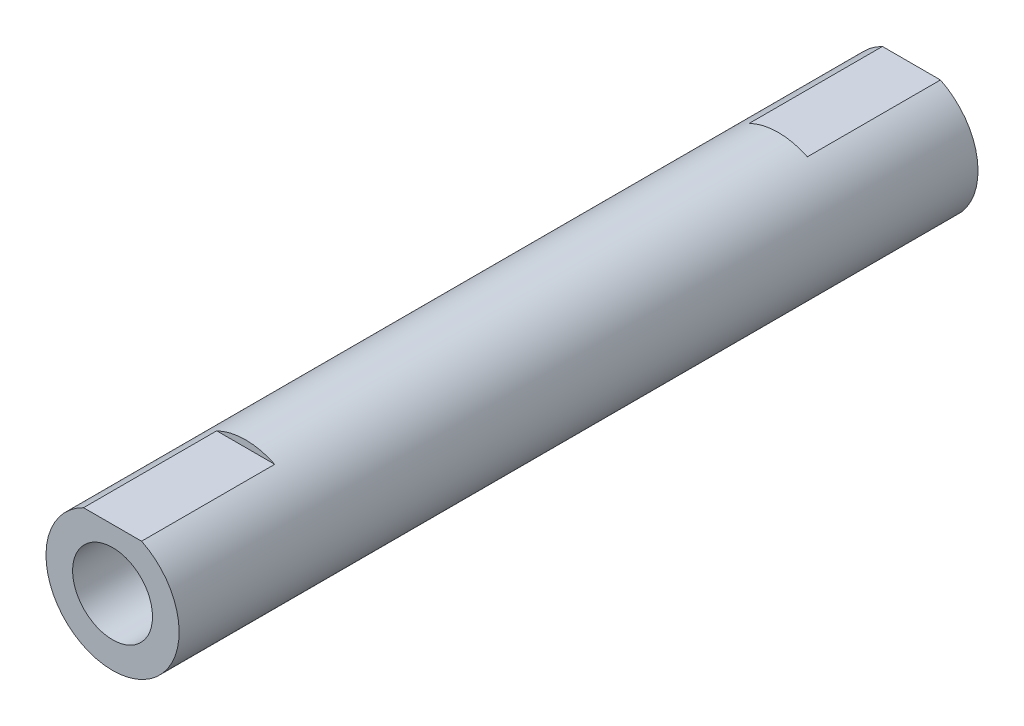
ISO-10303-21;
HEADER;
FILE_DESCRIPTION(('STEP AP214'),'2;1');
FILE_NAME('part.step','',(''),(''),'','','');
FILE_SCHEMA(('AUTOMOTIVE_DESIGN { 1 0 10303 214 1 1 1 1 }'));
ENDSEC;
DATA;
#1=APPLICATION_CONTEXT('core data for automotive mechanical design processes');
#2=APPLICATION_PROTOCOL_DEFINITION('international standard','automotive_design',2000,#1);
#3=PRODUCT_CONTEXT('',#1,'mechanical');
#4=PRODUCT('Part','Part','',(#3));
#5=PRODUCT_RELATED_PRODUCT_CATEGORY('part','',(#4));
#6=PRODUCT_DEFINITION_FORMATION('','',#4);
#7=PRODUCT_DEFINITION_CONTEXT('part definition',#1,'design');
#8=PRODUCT_DEFINITION('design','',#6,#7);
#9=PRODUCT_DEFINITION_SHAPE('','',#8);
#10=(LENGTH_UNIT() NAMED_UNIT(*) SI_UNIT(.MILLI.,.METRE.));
#11=(NAMED_UNIT(*) PLANE_ANGLE_UNIT() SI_UNIT($,.RADIAN.));
#12=(NAMED_UNIT(*) SI_UNIT($,.STERADIAN.) SOLID_ANGLE_UNIT());
#13=UNCERTAINTY_MEASURE_WITH_UNIT(LENGTH_MEASURE(1.E-05),#10,'distance_accuracy_value','');
#14=(GEOMETRIC_REPRESENTATION_CONTEXT(3) GLOBAL_UNCERTAINTY_ASSIGNED_CONTEXT((#13)) GLOBAL_UNIT_ASSIGNED_CONTEXT((#10,
#11,#12)) REPRESENTATION_CONTEXT('',''));
#15=CARTESIAN_POINT('',(0.,0.,0.));
#16=DIRECTION('',(0.,0.,1.));
#17=DIRECTION('',(1.,0.,0.));
#18=AXIS2_PLACEMENT_3D('',#15,#16,#17);
#19=CARTESIAN_POINT('',(0.,0.,30.));
#20=DIRECTION('',(0.,0.,1.));
#21=DIRECTION('',(1.,0.,0.));
#22=AXIS2_PLACEMENT_3D('',#19,#20,#21);
#23=PLANE('',#22);
#24=CARTESIAN_POINT('',(0.,0.,30.));
#25=DIRECTION('',(0.,0.,1.));
#26=DIRECTION('',(1.,0.,0.));
#27=AXIS2_PLACEMENT_3D('',#24,#25,#26);
#28=CIRCLE('',#27,3.);
#29=CARTESIAN_POINT('',(3.,0.,30.));
#30=VERTEX_POINT('',#29);
#31=EDGE_CURVE('E120',#30,#30,#28,.T.);
#32=ORIENTED_EDGE('',*,*,#31,.F.);
#33=EDGE_LOOP('',(#32));
#34=FACE_BOUND('',#33,.T.);
#35=CARTESIAN_POINT('',(0.,0.,30.));
#36=DIRECTION('',(0.,0.,1.));
#37=DIRECTION('',(1.,0.,0.));
#38=AXIS2_PLACEMENT_3D('',#35,#36,#37);
#39=CIRCLE('',#38,5.);
#40=CARTESIAN_POINT('',(-2.17944947177034,4.5,30.));
#41=VERTEX_POINT('',#40);
#42=CARTESIAN_POINT('',(2.17944947177034,4.5,30.));
#43=VERTEX_POINT('',#42);
#44=EDGE_CURVE('E11',#41,#43,#39,.T.);
#45=ORIENTED_EDGE('',*,*,#44,.T.);
#46=DIRECTION('',(-1.,0.,0.));
#47=VECTOR('',#46,1.);
#48=CARTESIAN_POINT('',(2.17944947177034,4.5,30.));
#49=LINE('',#48,#47);
#50=EDGE_CURVE('E100',#43,#41,#49,.T.);
#51=ORIENTED_EDGE('',*,*,#50,.T.);
#52=EDGE_LOOP('',(#45,#51));
#53=FACE_BOUND('',#52,.T.);
#54=ADVANCED_FACE('F39',(#34,#53),#23,.T.);
#55=CARTESIAN_POINT('',(0.,0.,30.));
#56=DIRECTION('',(0.,0.,-1.));
#57=DIRECTION('',(-1.,0.,0.));
#58=AXIS2_PLACEMENT_3D('',#55,#56,#57);
#59=CYLINDRICAL_SURFACE('',#58,5.);
#60=CARTESIAN_POINT('',(0.,0.,-20.));
#61=DIRECTION('',(0.,0.,1.));
#62=DIRECTION('',(1.,0.,0.));
#63=AXIS2_PLACEMENT_3D('',#60,#61,#62);
#64=CIRCLE('',#63,5.);
#65=CARTESIAN_POINT('',(2.17944947177034,4.5,-20.));
#66=VERTEX_POINT('',#65);
#67=CARTESIAN_POINT('',(-2.17944947177034,4.5,-20.));
#68=VERTEX_POINT('',#67);
#69=EDGE_CURVE('E82',#66,#68,#64,.T.);
#70=ORIENTED_EDGE('',*,*,#69,.T.);
#71=DIRECTION('',(0.,0.,-1.));
#72=VECTOR('',#71,1.);
#73=CARTESIAN_POINT('',(-2.17944947177034,4.5,-20.));
#74=LINE('',#73,#72);
#75=CARTESIAN_POINT('',(-2.17944947177034,4.5,-30.));
#76=VERTEX_POINT('',#75);
#77=EDGE_CURVE('E91',#68,#76,#74,.T.);
#78=ORIENTED_EDGE('',*,*,#77,.T.);
#79=CARTESIAN_POINT('',(0.,0.,-30.));
#80=DIRECTION('',(0.,0.,1.));
#81=DIRECTION('',(1.,0.,0.));
#82=AXIS2_PLACEMENT_3D('',#79,#80,#81);
#83=CIRCLE('',#82,5.);
#84=CARTESIAN_POINT('',(2.17944947177034,4.5,-30.));
#85=VERTEX_POINT('',#84);
#86=EDGE_CURVE('E43',#76,#85,#83,.T.);
#87=ORIENTED_EDGE('',*,*,#86,.T.);
#88=DIRECTION('',(0.,0.,-1.));
#89=VECTOR('',#88,1.);
#90=CARTESIAN_POINT('',(2.17944947177034,4.5,-20.));
#91=LINE('',#90,#89);
#92=EDGE_CURVE('E55',#66,#85,#91,.T.);
#93=ORIENTED_EDGE('',*,*,#92,.F.);
#94=EDGE_LOOP('',(#70,#78,#87,#93));
#95=FACE_BOUND('',#94,.T.);
#96=DIRECTION('',(0.,0.,1.));
#97=VECTOR('',#96,1.);
#98=CARTESIAN_POINT('',(2.17944947177034,4.5,20.));
#99=LINE('',#98,#97);
#100=CARTESIAN_POINT('',(2.17944947177034,4.5,20.));
#101=VERTEX_POINT('',#100);
#102=EDGE_CURVE('E113',#101,#43,#99,.T.);
#103=ORIENTED_EDGE('',*,*,#102,.T.);
#104=ORIENTED_EDGE('',*,*,#44,.F.);
#105=DIRECTION('',(0.,0.,1.));
#106=VECTOR('',#105,1.);
#107=CARTESIAN_POINT('',(-2.17944947177034,4.5,20.));
#108=LINE('',#107,#106);
#109=CARTESIAN_POINT('',(-2.17944947177034,4.5,20.));
#110=VERTEX_POINT('',#109);
#111=EDGE_CURVE('E109',#110,#41,#108,.T.);
#112=ORIENTED_EDGE('',*,*,#111,.F.);
#113=CARTESIAN_POINT('',(0.,0.,20.));
#114=DIRECTION('',(0.,0.,1.));
#115=DIRECTION('',(1.,0.,0.));
#116=AXIS2_PLACEMENT_3D('',#113,#114,#115);
#117=CIRCLE('',#116,5.);
#118=EDGE_CURVE('E104',#101,#110,#117,.T.);
#119=ORIENTED_EDGE('',*,*,#118,.F.);
#120=EDGE_LOOP('',(#103,#104,#112,#119));
#121=FACE_BOUND('',#120,.T.);
#122=ADVANCED_FACE('F41',(#95,#121),#59,.T.);
#123=CARTESIAN_POINT('',(0.,0.,-30.));
#124=DIRECTION('',(0.,0.,1.));
#125=DIRECTION('',(1.,0.,0.));
#126=AXIS2_PLACEMENT_3D('',#123,#124,#125);
#127=PLANE('',#126);
#128=ORIENTED_EDGE('',*,*,#86,.F.);
#129=DIRECTION('',(-1.,0.,0.));
#130=VECTOR('',#129,1.);
#131=CARTESIAN_POINT('',(2.17944947177034,4.5,-30.));
#132=LINE('',#131,#130);
#133=EDGE_CURVE('E88',#85,#76,#132,.T.);
#134=ORIENTED_EDGE('',*,*,#133,.F.);
#135=EDGE_LOOP('',(#128,#134));
#136=FACE_BOUND('',#135,.T.);
#137=CARTESIAN_POINT('',(0.,0.,-30.));
#138=DIRECTION('',(0.,0.,1.));
#139=DIRECTION('',(1.,0.,0.));
#140=AXIS2_PLACEMENT_3D('',#137,#138,#139);
#141=CIRCLE('',#140,3.);
#142=CARTESIAN_POINT('',(3.,0.,-30.));
#143=VERTEX_POINT('',#142);
#144=EDGE_CURVE('E117',#143,#143,#141,.T.);
#145=ORIENTED_EDGE('',*,*,#144,.T.);
#146=EDGE_LOOP('',(#145));
#147=FACE_BOUND('',#146,.T.);
#148=ADVANCED_FACE('F128',(#136,#147),#127,.F.);
#149=CARTESIAN_POINT('',(0.,0.,30.));
#150=DIRECTION('',(0.,0.,-1.));
#151=DIRECTION('',(-1.,0.,0.));
#152=AXIS2_PLACEMENT_3D('',#149,#150,#151);
#153=CYLINDRICAL_SURFACE('',#152,3.);
#154=ORIENTED_EDGE('',*,*,#31,.T.);
#155=EDGE_LOOP('',(#154));
#156=FACE_BOUND('',#155,.T.);
#157=ORIENTED_EDGE('',*,*,#144,.F.);
#158=EDGE_LOOP('',(#157));
#159=FACE_BOUND('',#158,.T.);
#160=ADVANCED_FACE('F130',(#156,#159),#153,.F.);
#161=CARTESIAN_POINT('',(2.17944947177034,4.5,20.));
#162=DIRECTION('',(0.,1.,0.));
#163=DIRECTION('',(0.,0.,1.));
#164=AXIS2_PLACEMENT_3D('',#161,#162,#163);
#165=PLANE('',#164);
#166=ORIENTED_EDGE('',*,*,#50,.F.);
#167=ORIENTED_EDGE('',*,*,#102,.F.);
#168=DIRECTION('',(-1.,0.,0.));
#169=VECTOR('',#168,1.);
#170=CARTESIAN_POINT('',(2.17944947177034,4.5,20.));
#171=LINE('',#170,#169);
#172=EDGE_CURVE('E62',#101,#110,#171,.T.);
#173=ORIENTED_EDGE('',*,*,#172,.T.);
#174=ORIENTED_EDGE('',*,*,#111,.T.);
#175=EDGE_LOOP('',(#166,#167,#173,#174));
#176=FACE_BOUND('',#175,.T.);
#177=ADVANCED_FACE('F132',(#176),#165,.T.);
#178=CARTESIAN_POINT('',(0.,0.,20.));
#179=DIRECTION('',(0.,0.,1.));
#180=DIRECTION('',(1.,0.,0.));
#181=AXIS2_PLACEMENT_3D('',#178,#179,#180);
#182=PLANE('',#181);
#183=ORIENTED_EDGE('',*,*,#118,.T.);
#184=ORIENTED_EDGE('',*,*,#172,.F.);
#185=EDGE_LOOP('',(#183,#184));
#186=FACE_BOUND('',#185,.T.);
#187=ADVANCED_FACE('F139',(#186),#182,.T.);
#188=CARTESIAN_POINT('',(2.17944947177034,4.5,-20.));
#189=DIRECTION('',(0.,-1.,0.));
#190=DIRECTION('',(0.,0.,-1.));
#191=AXIS2_PLACEMENT_3D('',#188,#189,#190);
#192=PLANE('',#191);
#193=ORIENTED_EDGE('',*,*,#133,.T.);
#194=ORIENTED_EDGE('',*,*,#77,.F.);
#195=DIRECTION('',(-1.,0.,0.));
#196=VECTOR('',#195,1.);
#197=CARTESIAN_POINT('',(2.17944947177034,4.5,-20.));
#198=LINE('',#197,#196);
#199=EDGE_CURVE('E84',#66,#68,#198,.T.);
#200=ORIENTED_EDGE('',*,*,#199,.F.);
#201=ORIENTED_EDGE('',*,*,#92,.T.);
#202=EDGE_LOOP('',(#193,#194,#200,#201));
#203=FACE_BOUND('',#202,.T.);
#204=ADVANCED_FACE('F90',(#203),#192,.F.);
#205=CARTESIAN_POINT('',(0.,0.,-20.));
#206=DIRECTION('',(0.,0.,-1.));
#207=DIRECTION('',(1.,0.,0.));
#208=AXIS2_PLACEMENT_3D('',#205,#206,#207);
#209=PLANE('',#208);
#210=ORIENTED_EDGE('',*,*,#69,.F.);
#211=ORIENTED_EDGE('',*,*,#199,.T.);
#212=EDGE_LOOP('',(#210,#211));
#213=FACE_BOUND('',#212,.T.);
#214=ADVANCED_FACE('F83',(#213),#209,.T.);
#215=CLOSED_SHELL('',(#54,#122,#148,#160,#177,#187,#204,#214));
#216=MANIFOLD_SOLID_BREP('B2',#215);
#217=ADVANCED_BREP_SHAPE_REPRESENTATION('',(#18,#216),#14);
#218=SHAPE_DEFINITION_REPRESENTATION(#9,#217);
ENDSEC;
END-ISO-10303-21;
